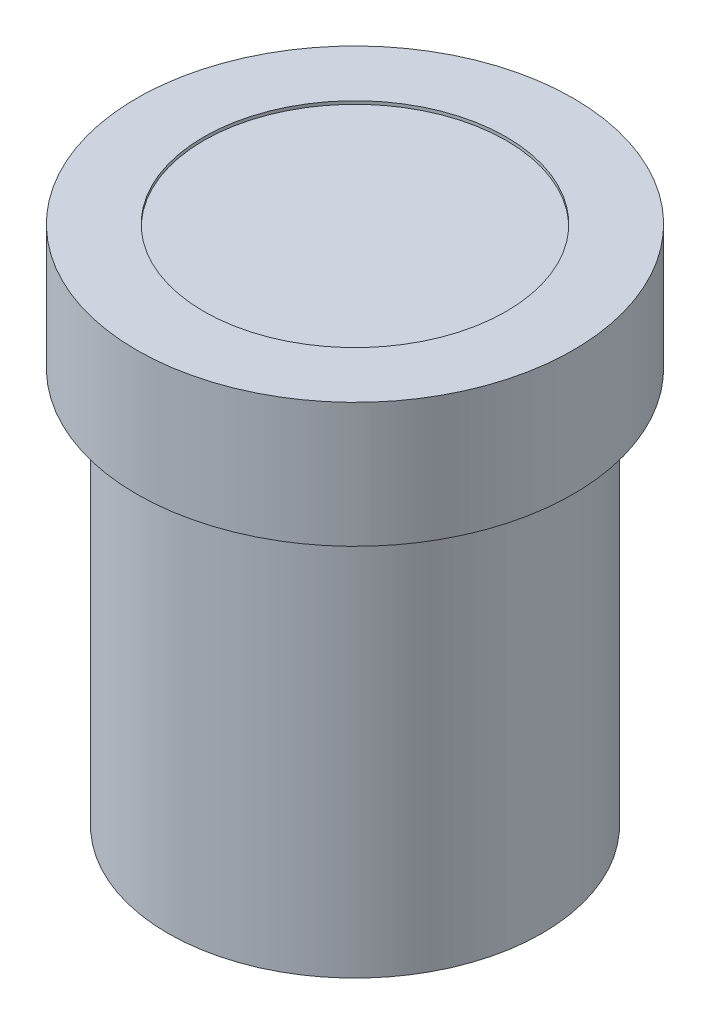
ISO-10303-21;
HEADER;
FILE_DESCRIPTION(('STEP AP214'),'2;1');
FILE_NAME('part.step','',(''),(''),'','','');
FILE_SCHEMA(('AUTOMOTIVE_DESIGN { 1 0 10303 214 1 1 1 1 }'));
ENDSEC;
DATA;
#1=APPLICATION_CONTEXT('core data for automotive mechanical design processes');
#2=APPLICATION_PROTOCOL_DEFINITION('international standard','automotive_design',2000,#1);
#3=PRODUCT_CONTEXT('',#1,'mechanical');
#4=PRODUCT('Part','Part','',(#3));
#5=PRODUCT_RELATED_PRODUCT_CATEGORY('part','',(#4));
#6=PRODUCT_DEFINITION_FORMATION('','',#4);
#7=PRODUCT_DEFINITION_CONTEXT('part definition',#1,'design');
#8=PRODUCT_DEFINITION('design','',#6,#7);
#9=PRODUCT_DEFINITION_SHAPE('','',#8);
#10=(LENGTH_UNIT() NAMED_UNIT(*) SI_UNIT(.MILLI.,.METRE.));
#11=(NAMED_UNIT(*) PLANE_ANGLE_UNIT() SI_UNIT($,.RADIAN.));
#12=(NAMED_UNIT(*) SI_UNIT($,.STERADIAN.) SOLID_ANGLE_UNIT());
#13=UNCERTAINTY_MEASURE_WITH_UNIT(LENGTH_MEASURE(1.E-05),#10,'distance_accuracy_value','');
#14=(GEOMETRIC_REPRESENTATION_CONTEXT(3) GLOBAL_UNCERTAINTY_ASSIGNED_CONTEXT((#13)) GLOBAL_UNIT_ASSIGNED_CONTEXT((#10,
#11,#12)) REPRESENTATION_CONTEXT('',''));
#15=CARTESIAN_POINT('',(0.,0.,0.));
#16=DIRECTION('',(0.,0.,1.));
#17=DIRECTION('',(1.,0.,0.));
#18=AXIS2_PLACEMENT_3D('',#15,#16,#17);
#19=CARTESIAN_POINT('',(0.,16.7,0.));
#20=DIRECTION('',(0.,-1.,0.));
#21=DIRECTION('',(0.,0.,-1.));
#22=AXIS2_PLACEMENT_3D('',#19,#20,#21);
#23=CYLINDRICAL_SURFACE('',#22,4.85);
#24=CARTESIAN_POINT('',(0.,12.7,0.));
#25=DIRECTION('',(0.,1.,0.));
#26=DIRECTION('',(0.,0.,1.));
#27=AXIS2_PLACEMENT_3D('',#24,#25,#26);
#28=CIRCLE('',#27,4.85);
#29=CARTESIAN_POINT('',(0.,12.7,4.85));
#30=VERTEX_POINT('',#29);
#31=EDGE_CURVE('E41',#30,#30,#28,.F.);
#32=ORIENTED_EDGE('',*,*,#31,.T.);
#33=EDGE_LOOP('',(#32));
#34=FACE_BOUND('',#33,.T.);
#35=CARTESIAN_POINT('',(0.,16.5,0.));
#36=DIRECTION('',(0.,1.,0.));
#37=DIRECTION('',(0.,0.,1.));
#38=AXIS2_PLACEMENT_3D('',#35,#36,#37);
#39=CIRCLE('',#38,4.85);
#40=CARTESIAN_POINT('',(0.,16.5,4.85));
#41=VERTEX_POINT('',#40);
#42=EDGE_CURVE('E65',#41,#41,#39,.T.);
#43=ORIENTED_EDGE('',*,*,#42,.T.);
#44=EDGE_LOOP('',(#43));
#45=FACE_BOUND('',#44,.T.);
#46=ADVANCED_FACE('F34',(#34,#45),#23,.F.);
#47=CARTESIAN_POINT('',(0.,12.7,0.));
#48=DIRECTION('',(0.,1.,0.));
#49=DIRECTION('',(0.,0.,1.));
#50=AXIS2_PLACEMENT_3D('',#47,#48,#49);
#51=PLANE('',#50);
#52=CARTESIAN_POINT('',(0.,12.7,0.));
#53=DIRECTION('',(0.,1.,0.));
#54=DIRECTION('',(0.,0.,1.));
#55=AXIS2_PLACEMENT_3D('',#52,#53,#54);
#56=CIRCLE('',#55,2.25);
#57=CARTESIAN_POINT('',(0.,12.7,2.25));
#58=VERTEX_POINT('',#57);
#59=EDGE_CURVE('E53',#58,#58,#56,.T.);
#60=ORIENTED_EDGE('',*,*,#59,.F.);
#61=EDGE_LOOP('',(#60));
#62=FACE_BOUND('',#61,.T.);
#63=ORIENTED_EDGE('',*,*,#31,.F.);
#64=EDGE_LOOP('',(#63));
#65=FACE_BOUND('',#64,.T.);
#66=ADVANCED_FACE('F84',(#62,#65),#51,.T.);
#67=CARTESIAN_POINT('',(0.,0.,0.));
#68=DIRECTION('',(0.,1.,0.));
#69=DIRECTION('',(0.,0.,1.));
#70=AXIS2_PLACEMENT_3D('',#67,#68,#69);
#71=PLANE('',#70);
#72=CARTESIAN_POINT('',(0.,0.,0.));
#73=DIRECTION('',(0.,1.,0.));
#74=DIRECTION('',(0.,0.,1.));
#75=AXIS2_PLACEMENT_3D('',#72,#73,#74);
#76=CIRCLE('',#75,6.);
#77=CARTESIAN_POINT('',(0.,0.,6.));
#78=VERTEX_POINT('',#77);
#79=EDGE_CURVE('E49',#78,#78,#76,.T.);
#80=ORIENTED_EDGE('',*,*,#79,.F.);
#81=EDGE_LOOP('',(#80));
#82=FACE_BOUND('',#81,.T.);
#83=CARTESIAN_POINT('',(0.,0.,0.));
#84=DIRECTION('',(0.,1.,0.));
#85=DIRECTION('',(0.,0.,1.));
#86=AXIS2_PLACEMENT_3D('',#83,#84,#85);
#87=CIRCLE('',#86,2.25);
#88=CARTESIAN_POINT('',(0.,0.,2.25));
#89=VERTEX_POINT('',#88);
#90=EDGE_CURVE('E55',#89,#89,#87,.T.);
#91=ORIENTED_EDGE('',*,*,#90,.T.);
#92=EDGE_LOOP('',(#91));
#93=FACE_BOUND('',#92,.T.);
#94=ADVANCED_FACE('F90',(#82,#93),#71,.F.);
#95=CARTESIAN_POINT('',(0.,12.7,0.));
#96=DIRECTION('',(0.,-1.,0.));
#97=DIRECTION('',(0.,0.,-1.));
#98=AXIS2_PLACEMENT_3D('',#95,#96,#97);
#99=CYLINDRICAL_SURFACE('',#98,6.);
#100=CARTESIAN_POINT('',(0.,12.7,0.));
#101=DIRECTION('',(0.,1.,0.));
#102=DIRECTION('',(0.,0.,1.));
#103=AXIS2_PLACEMENT_3D('',#100,#101,#102);
#104=CIRCLE('',#103,6.);
#105=CARTESIAN_POINT('',(0.,12.7,6.));
#106=VERTEX_POINT('',#105);
#107=EDGE_CURVE('E45',#106,#106,#104,.T.);
#108=ORIENTED_EDGE('',*,*,#107,.F.);
#109=EDGE_LOOP('',(#108));
#110=FACE_BOUND('',#109,.T.);
#111=ORIENTED_EDGE('',*,*,#79,.T.);
#112=EDGE_LOOP('',(#111));
#113=FACE_BOUND('',#112,.T.);
#114=ADVANCED_FACE('F36',(#110,#113),#99,.T.);
#115=CARTESIAN_POINT('',(0.,12.7,0.));
#116=DIRECTION('',(0.,-1.,0.));
#117=DIRECTION('',(0.,0.,-1.));
#118=AXIS2_PLACEMENT_3D('',#115,#116,#117);
#119=CYLINDRICAL_SURFACE('',#118,2.25);
#120=ORIENTED_EDGE('',*,*,#59,.T.);
#121=EDGE_LOOP('',(#120));
#122=FACE_BOUND('',#121,.T.);
#123=ORIENTED_EDGE('',*,*,#90,.F.);
#124=EDGE_LOOP('',(#123));
#125=FACE_BOUND('',#124,.T.);
#126=ADVANCED_FACE('F105',(#122,#125),#119,.F.);
#127=CARTESIAN_POINT('',(0.,16.7,0.));
#128=DIRECTION('',(0.,-1.,0.));
#129=DIRECTION('',(0.,0.,-1.));
#130=AXIS2_PLACEMENT_3D('',#127,#128,#129);
#131=CYLINDRICAL_SURFACE('',#130,7.);
#132=CARTESIAN_POINT('',(0.,16.7,0.));
#133=DIRECTION('',(0.,1.,0.));
#134=DIRECTION('',(0.,0.,1.));
#135=AXIS2_PLACEMENT_3D('',#132,#133,#134);
#136=CIRCLE('',#135,7.);
#137=CARTESIAN_POINT('',(0.,16.7,7.));
#138=VERTEX_POINT('',#137);
#139=EDGE_CURVE('E64',#138,#138,#136,.T.);
#140=ORIENTED_EDGE('',*,*,#139,.F.);
#141=EDGE_LOOP('',(#140));
#142=FACE_BOUND('',#141,.T.);
#143=CARTESIAN_POINT('',(0.,12.7,0.));
#144=DIRECTION('',(0.,1.,0.));
#145=DIRECTION('',(0.,0.,1.));
#146=AXIS2_PLACEMENT_3D('',#143,#144,#145);
#147=CIRCLE('',#146,7.);
#148=CARTESIAN_POINT('',(0.,12.7,7.));
#149=VERTEX_POINT('',#148);
#150=EDGE_CURVE('E61',#149,#149,#147,.T.);
#151=ORIENTED_EDGE('',*,*,#150,.T.);
#152=EDGE_LOOP('',(#151));
#153=FACE_BOUND('',#152,.T.);
#154=ADVANCED_FACE('F97',(#142,#153),#131,.T.);
#155=CARTESIAN_POINT('',(0.,16.6,0.));
#156=DIRECTION('',(0.,1.,0.));
#157=DIRECTION('',(0.,0.,1.));
#158=AXIS2_PLACEMENT_3D('',#155,#156,#157);
#159=CIRCLE('',#158,4.85);
#160=CARTESIAN_POINT('',(0.,16.6,4.85));
#161=VERTEX_POINT('',#160);
#162=EDGE_CURVE('E10',#161,#161,#159,.T.);
#163=ORIENTED_EDGE('',*,*,#162,.F.);
#164=EDGE_LOOP('',(#163));
#165=FACE_BOUND('',#164,.T.);
#166=CARTESIAN_POINT('',(0.,16.7,0.));
#167=DIRECTION('',(0.,1.,0.));
#168=DIRECTION('',(0.,0.,1.));
#169=AXIS2_PLACEMENT_3D('',#166,#167,#168);
#170=CIRCLE('',#169,4.85);
#171=CARTESIAN_POINT('',(0.,16.7,4.85));
#172=VERTEX_POINT('',#171);
#173=EDGE_CURVE('E58',#172,#172,#170,.T.);
#174=ORIENTED_EDGE('',*,*,#173,.T.);
#175=EDGE_LOOP('',(#174));
#176=FACE_BOUND('',#175,.T.);
#177=ADVANCED_FACE('F86',(#165,#176),#23,.F.);
#178=CARTESIAN_POINT('',(0.,16.7,0.));
#179=DIRECTION('',(0.,1.,0.));
#180=DIRECTION('',(0.,0.,1.));
#181=AXIS2_PLACEMENT_3D('',#178,#179,#180);
#182=PLANE('',#181);
#183=ORIENTED_EDGE('',*,*,#139,.T.);
#184=EDGE_LOOP('',(#183));
#185=FACE_BOUND('',#184,.T.);
#186=ORIENTED_EDGE('',*,*,#173,.F.);
#187=EDGE_LOOP('',(#186));
#188=FACE_BOUND('',#187,.T.);
#189=ADVANCED_FACE('F96',(#185,#188),#182,.T.);
#190=CARTESIAN_POINT('',(0.,12.7,0.));
#191=DIRECTION('',(0.,1.,0.));
#192=DIRECTION('',(0.,0.,1.));
#193=AXIS2_PLACEMENT_3D('',#190,#191,#192);
#194=PLANE('',#193);
#195=ORIENTED_EDGE('',*,*,#107,.T.);
#196=EDGE_LOOP('',(#195));
#197=FACE_BOUND('',#196,.T.);
#198=ORIENTED_EDGE('',*,*,#150,.F.);
#199=EDGE_LOOP('',(#198));
#200=FACE_BOUND('',#199,.T.);
#201=ADVANCED_FACE('F81',(#197,#200),#194,.F.);
#202=CARTESIAN_POINT('',(0.,16.6,0.));
#203=DIRECTION('',(0.,1.,0.));
#204=DIRECTION('',(0.,0.,1.));
#205=AXIS2_PLACEMENT_3D('',#202,#203,#204);
#206=PLANE('',#205);
#207=ORIENTED_EDGE('',*,*,#162,.T.);
#208=EDGE_LOOP('',(#207));
#209=FACE_BOUND('',#208,.T.);
#210=ADVANCED_FACE('F76',(#209),#206,.T.);
#211=CARTESIAN_POINT('',(0.,16.5,0.));
#212=DIRECTION('',(0.,1.,0.));
#213=DIRECTION('',(0.,0.,1.));
#214=AXIS2_PLACEMENT_3D('',#211,#212,#213);
#215=PLANE('',#214);
#216=ORIENTED_EDGE('',*,*,#42,.F.);
#217=EDGE_LOOP('',(#216));
#218=FACE_BOUND('',#217,.T.);
#219=ADVANCED_FACE('F74',(#218),#215,.F.);
#220=CLOSED_SHELL('',(#46,#66,#94,#114,#126,#154,#177,#189,#201,#210,#219));
#221=MANIFOLD_SOLID_BREP('B2',#220);
#222=ADVANCED_BREP_SHAPE_REPRESENTATION('',(#18,#221),#14);
#223=SHAPE_DEFINITION_REPRESENTATION(#9,#222);
ENDSEC;
END-ISO-10303-21;
